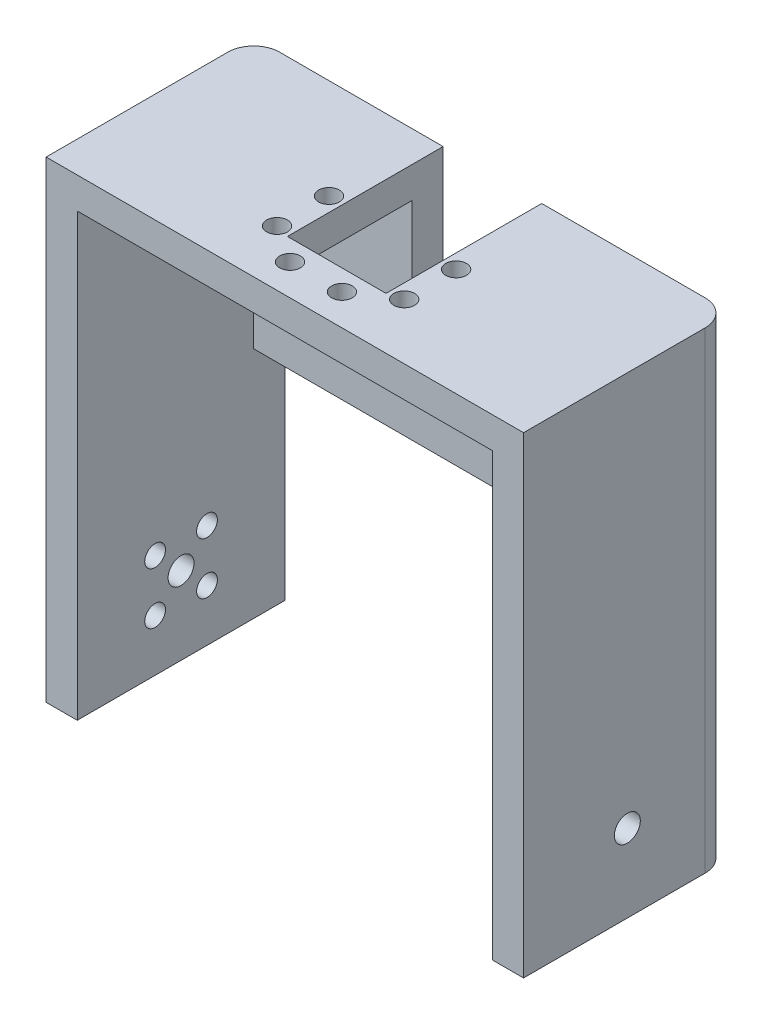
ISO-10303-21;
HEADER;
FILE_DESCRIPTION(('STEP AP214'),'2;1');
FILE_NAME('part.step','',(''),(''),'','','');
FILE_SCHEMA(('AUTOMOTIVE_DESIGN { 1 0 10303 214 1 1 1 1 }'));
ENDSEC;
DATA;
#1=APPLICATION_CONTEXT('core data for automotive mechanical design processes');
#2=APPLICATION_PROTOCOL_DEFINITION('international standard','automotive_design',2000,#1);
#3=PRODUCT_CONTEXT('',#1,'mechanical');
#4=PRODUCT('Part','Part','',(#3));
#5=PRODUCT_RELATED_PRODUCT_CATEGORY('part','',(#4));
#6=PRODUCT_DEFINITION_FORMATION('','',#4);
#7=PRODUCT_DEFINITION_CONTEXT('part definition',#1,'design');
#8=PRODUCT_DEFINITION('design','',#6,#7);
#9=PRODUCT_DEFINITION_SHAPE('','',#8);
#10=(LENGTH_UNIT() NAMED_UNIT(*) SI_UNIT(.MILLI.,.METRE.));
#11=(NAMED_UNIT(*) PLANE_ANGLE_UNIT() SI_UNIT($,.RADIAN.));
#12=(NAMED_UNIT(*) SI_UNIT($,.STERADIAN.) SOLID_ANGLE_UNIT());
#13=UNCERTAINTY_MEASURE_WITH_UNIT(LENGTH_MEASURE(1.E-05),#10,'distance_accuracy_value','');
#14=(GEOMETRIC_REPRESENTATION_CONTEXT(3) GLOBAL_UNCERTAINTY_ASSIGNED_CONTEXT((#13)) GLOBAL_UNIT_ASSIGNED_CONTEXT((#10,
#11,#12)) REPRESENTATION_CONTEXT('',''));
#15=CARTESIAN_POINT('',(0.,0.,0.));
#16=DIRECTION('',(0.,0.,1.));
#17=DIRECTION('',(1.,0.,0.));
#18=AXIS2_PLACEMENT_3D('',#15,#16,#17);
#19=CARTESIAN_POINT('',(-31.1459169574739,-11.0012437810945,40.));
#20=DIRECTION('',(-1.,0.,0.));
#21=DIRECTION('',(0.,0.,1.));
#22=AXIS2_PLACEMENT_3D('',#19,#20,#21);
#23=PLANE('',#22);
#24=CARTESIAN_POINT('',(-31.1459169574739,-41.0012437810945,25.));
#25=DIRECTION('',(-1.,0.,0.));
#26=DIRECTION('',(0.,0.,1.));
#27=AXIS2_PLACEMENT_3D('',#24,#25,#26);
#28=CIRCLE('',#27,2.);
#29=CARTESIAN_POINT('',(-31.1459169574739,-41.0012437810945,27.));
#30=VERTEX_POINT('',#29);
#31=EDGE_CURVE('E185',#30,#30,#28,.T.);
#32=ORIENTED_EDGE('',*,*,#31,.T.);
#33=EDGE_LOOP('',(#32));
#34=FACE_BOUND('',#33,.T.);
#35=CARTESIAN_POINT('',(-31.1459169574739,-51.0012437810945,15.));
#36=DIRECTION('',(-1.,0.,0.));
#37=DIRECTION('',(0.,0.,1.));
#38=AXIS2_PLACEMENT_3D('',#35,#36,#37);
#39=CIRCLE('',#38,2.);
#40=CARTESIAN_POINT('',(-31.1459169574739,-51.0012437810945,17.));
#41=VERTEX_POINT('',#40);
#42=EDGE_CURVE('E188',#41,#41,#39,.T.);
#43=ORIENTED_EDGE('',*,*,#42,.T.);
#44=EDGE_LOOP('',(#43));
#45=FACE_BOUND('',#44,.T.);
#46=CARTESIAN_POINT('',(-31.1459169574739,-41.0012437810945,15.));
#47=DIRECTION('',(-1.,0.,0.));
#48=DIRECTION('',(0.,0.,1.));
#49=AXIS2_PLACEMENT_3D('',#46,#47,#48);
#50=CIRCLE('',#49,2.);
#51=CARTESIAN_POINT('',(-31.1459169574739,-41.0012437810945,17.));
#52=VERTEX_POINT('',#51);
#53=EDGE_CURVE('E520',#52,#52,#50,.T.);
#54=ORIENTED_EDGE('',*,*,#53,.T.);
#55=EDGE_LOOP('',(#54));
#56=FACE_BOUND('',#55,.T.);
#57=CARTESIAN_POINT('',(-31.1459169574739,-51.0012437810945,25.));
#58=DIRECTION('',(-1.,0.,0.));
#59=DIRECTION('',(0.,0.,1.));
#60=AXIS2_PLACEMENT_3D('',#57,#58,#59);
#61=CIRCLE('',#60,2.);
#62=CARTESIAN_POINT('',(-31.1459169574739,-51.0012437810945,27.));
#63=VERTEX_POINT('',#62);
#64=EDGE_CURVE('E517',#63,#63,#61,.T.);
#65=ORIENTED_EDGE('',*,*,#64,.T.);
#66=EDGE_LOOP('',(#65));
#67=FACE_BOUND('',#66,.T.);
#68=CARTESIAN_POINT('',(-31.1459169574739,-46.0012437810945,20.));
#69=DIRECTION('',(-1.,0.,0.));
#70=DIRECTION('',(0.,0.,1.));
#71=AXIS2_PLACEMENT_3D('',#68,#69,#70);
#72=CIRCLE('',#71,2.5);
#73=CARTESIAN_POINT('',(-31.1459169574739,-46.0012437810945,22.5));
#74=VERTEX_POINT('',#73);
#75=EDGE_CURVE('E223',#74,#74,#72,.T.);
#76=ORIENTED_EDGE('',*,*,#75,.T.);
#77=EDGE_LOOP('',(#76));
#78=FACE_BOUND('',#77,.T.);
#79=DIRECTION('',(0.,1.,0.));
#80=VECTOR('',#79,1.);
#81=CARTESIAN_POINT('',(-31.1459169574739,-16.0012437810945,6.));
#82=LINE('',#81,#80);
#83=CARTESIAN_POINT('',(-31.1459169574739,-16.0012437810945,6.));
#84=VERTEX_POINT('',#83);
#85=CARTESIAN_POINT('',(-31.1459169574739,23.9987562189055,6.));
#86=VERTEX_POINT('',#85);
#87=EDGE_CURVE('E207',#84,#86,#82,.T.);
#88=ORIENTED_EDGE('',*,*,#87,.T.);
#89=DIRECTION('',(0.,0.,-1.));
#90=VECTOR('',#89,1.);
#91=CARTESIAN_POINT('',(-31.1459169574739,23.9987562189055,40.));
#92=LINE('',#91,#90);
#93=CARTESIAN_POINT('',(-31.1459169574739,23.9987562189055,40.));
#94=VERTEX_POINT('',#93);
#95=EDGE_CURVE('E327',#94,#86,#92,.T.);
#96=ORIENTED_EDGE('',*,*,#95,.F.);
#97=DIRECTION('',(0.,1.,0.));
#98=VECTOR('',#97,1.);
#99=CARTESIAN_POINT('',(-31.1459169574739,-11.0012437810945,40.));
#100=LINE('',#99,#98);
#101=CARTESIAN_POINT('',(-31.1459169574739,-61.0012437810945,40.));
#102=VERTEX_POINT('',#101);
#103=EDGE_CURVE('E315',#102,#94,#100,.T.);
#104=ORIENTED_EDGE('',*,*,#103,.F.);
#105=DIRECTION('',(0.,0.,1.));
#106=VECTOR('',#105,1.);
#107=CARTESIAN_POINT('',(-31.1459169574739,-61.0012437810945,40.));
#108=LINE('',#107,#106);
#109=CARTESIAN_POINT('',(-31.1459169574739,-61.0012437810945,0.));
#110=VERTEX_POINT('',#109);
#111=EDGE_CURVE('E241',#110,#102,#108,.T.);
#112=ORIENTED_EDGE('',*,*,#111,.F.);
#113=DIRECTION('',(0.,1.,0.));
#114=VECTOR('',#113,1.);
#115=CARTESIAN_POINT('',(-31.1459169574739,-11.0012437810945,0.));
#116=LINE('',#115,#114);
#117=CARTESIAN_POINT('',(-31.1459169574739,-16.0012437810945,0.));
#118=VERTEX_POINT('',#117);
#119=EDGE_CURVE('E313',#110,#118,#116,.T.);
#120=ORIENTED_EDGE('',*,*,#119,.T.);
#121=DIRECTION('',(0.,0.,-1.));
#122=VECTOR('',#121,1.);
#123=CARTESIAN_POINT('',(-31.1459169574739,-16.0012437810945,0.));
#124=LINE('',#123,#122);
#125=EDGE_CURVE('E194',#84,#118,#124,.T.);
#126=ORIENTED_EDGE('',*,*,#125,.F.);
#127=EDGE_LOOP('',(#88,#96,#104,#112,#120,#126));
#128=FACE_BOUND('',#127,.T.);
#129=ADVANCED_FACE('F36',(#34,#45,#56,#67,#78,#128),#23,.F.);
#130=CARTESIAN_POINT('',(-31.1459169574739,23.9987562189055,40.));
#131=DIRECTION('',(0.,1.,0.));
#132=DIRECTION('',(0.,0.,1.));
#133=AXIS2_PLACEMENT_3D('',#130,#131,#132);
#134=PLANE('',#133);
#135=CARTESIAN_POINT('',(-3.39591695747392,23.9987562189055,19.25));
#136=DIRECTION('',(0.,1.,0.));
#137=DIRECTION('',(0.,0.,1.));
#138=AXIS2_PLACEMENT_3D('',#135,#136,#137);
#139=CIRCLE('',#138,2.);
#140=CARTESIAN_POINT('',(-3.39591695747392,23.9987562189055,21.25));
#141=VERTEX_POINT('',#140);
#142=EDGE_CURVE('E290',#141,#141,#139,.T.);
#143=ORIENTED_EDGE('',*,*,#142,.T.);
#144=EDGE_LOOP('',(#143));
#145=FACE_BOUND('',#144,.T.);
#146=CARTESIAN_POINT('',(-3.39591695747392,23.9987562189055,29.25));
#147=DIRECTION('',(0.,1.,0.));
#148=DIRECTION('',(0.,0.,1.));
#149=AXIS2_PLACEMENT_3D('',#146,#147,#148);
#150=CIRCLE('',#149,2.);
#151=CARTESIAN_POINT('',(-3.39591695747392,23.9987562189055,31.25));
#152=VERTEX_POINT('',#151);
#153=EDGE_CURVE('E287',#152,#152,#150,.T.);
#154=ORIENTED_EDGE('',*,*,#153,.T.);
#155=EDGE_LOOP('',(#154));
#156=FACE_BOUND('',#155,.T.);
#157=DIRECTION('',(0.,0.,1.));
#158=VECTOR('',#157,1.);
#159=CARTESIAN_POINT('',(-0.645916957473888,23.9987562189055,40.));
#160=LINE('',#159,#158);
#161=CARTESIAN_POINT('',(-0.645916957473899,23.9987562189055,6.));
#162=VERTEX_POINT('',#161);
#163=CARTESIAN_POINT('',(-0.64591695747389,23.9987562189055,30.));
#164=VERTEX_POINT('',#163);
#165=EDGE_CURVE('E278',#162,#164,#160,.T.);
#166=ORIENTED_EDGE('',*,*,#165,.T.);
#167=DIRECTION('',(1.,0.,0.));
#168=VECTOR('',#167,1.);
#169=CARTESIAN_POINT('',(-31.1459169574739,23.9987562189055,30.));
#170=LINE('',#169,#168);
#171=CARTESIAN_POINT('',(18.3540830425261,23.9987562189055,30.));
#172=VERTEX_POINT('',#171);
#173=EDGE_CURVE('E171',#164,#172,#170,.T.);
#174=ORIENTED_EDGE('',*,*,#173,.T.);
#175=DIRECTION('',(0.,0.,-1.));
#176=VECTOR('',#175,1.);
#177=CARTESIAN_POINT('',(18.3540830425261,23.9987562189055,40.));
#178=LINE('',#177,#176);
#179=CARTESIAN_POINT('',(18.3540830425261,23.9987562189055,6.));
#180=VERTEX_POINT('',#179);
#181=EDGE_CURVE('E170',#172,#180,#178,.T.);
#182=ORIENTED_EDGE('',*,*,#181,.T.);
#183=DIRECTION('',(-1.,0.,0.));
#184=VECTOR('',#183,1.);
#185=CARTESIAN_POINT('',(-31.1459169574739,23.9987562189055,6.));
#186=LINE('',#185,#184);
#187=CARTESIAN_POINT('',(48.8540830425261,23.9987562189055,6.));
#188=VERTEX_POINT('',#187);
#189=EDGE_CURVE('E198',#188,#180,#186,.T.);
#190=ORIENTED_EDGE('',*,*,#189,.F.);
#191=DIRECTION('',(0.,0.,-1.));
#192=VECTOR('',#191,1.);
#193=CARTESIAN_POINT('',(48.8540830425261,23.9987562189055,40.));
#194=LINE('',#193,#192);
#195=CARTESIAN_POINT('',(48.8540830425261,23.9987562189055,40.));
#196=VERTEX_POINT('',#195);
#197=EDGE_CURVE('E322',#196,#188,#194,.T.);
#198=ORIENTED_EDGE('',*,*,#197,.F.);
#199=DIRECTION('',(1.,0.,0.));
#200=VECTOR('',#199,1.);
#201=CARTESIAN_POINT('',(-31.1459169574739,23.9987562189055,40.));
#202=LINE('',#201,#200);
#203=EDGE_CURVE('E317',#94,#196,#202,.T.);
#204=ORIENTED_EDGE('',*,*,#203,.F.);
#205=ORIENTED_EDGE('',*,*,#95,.T.);
#206=EDGE_CURVE('E192',#162,#86,#186,.T.);
#207=ORIENTED_EDGE('',*,*,#206,.F.);
#208=EDGE_LOOP('',(#166,#174,#182,#190,#198,#204,#205,#207));
#209=FACE_BOUND('',#208,.T.);
#210=CARTESIAN_POINT('',(3.85408304252608,23.9987562189055,34.));
#211=DIRECTION('',(0.,1.,0.));
#212=DIRECTION('',(0.,0.,1.));
#213=AXIS2_PLACEMENT_3D('',#210,#211,#212);
#214=CIRCLE('',#213,2.);
#215=CARTESIAN_POINT('',(3.85408304252608,23.9987562189055,36.));
#216=VERTEX_POINT('',#215);
#217=EDGE_CURVE('E284',#216,#216,#214,.T.);
#218=ORIENTED_EDGE('',*,*,#217,.T.);
#219=EDGE_LOOP('',(#218));
#220=FACE_BOUND('',#219,.T.);
#221=CARTESIAN_POINT('',(13.8540830425261,23.9987562189055,34.));
#222=DIRECTION('',(0.,1.,0.));
#223=DIRECTION('',(0.,0.,1.));
#224=AXIS2_PLACEMENT_3D('',#221,#222,#223);
#225=CIRCLE('',#224,2.);
#226=CARTESIAN_POINT('',(13.8540830425261,23.9987562189055,36.));
#227=VERTEX_POINT('',#226);
#228=EDGE_CURVE('E274',#227,#227,#225,.T.);
#229=ORIENTED_EDGE('',*,*,#228,.T.);
#230=EDGE_LOOP('',(#229));
#231=FACE_BOUND('',#230,.T.);
#232=CARTESIAN_POINT('',(21.1040830425261,23.9987562189055,19.25));
#233=DIRECTION('',(0.,1.,0.));
#234=DIRECTION('',(0.,0.,1.));
#235=AXIS2_PLACEMENT_3D('',#232,#233,#234);
#236=CIRCLE('',#235,2.00000000000001);
#237=CARTESIAN_POINT('',(21.1040830425261,23.9987562189055,21.25));
#238=VERTEX_POINT('',#237);
#239=EDGE_CURVE('E293',#238,#238,#236,.T.);
#240=ORIENTED_EDGE('',*,*,#239,.T.);
#241=EDGE_LOOP('',(#240));
#242=FACE_BOUND('',#241,.T.);
#243=CARTESIAN_POINT('',(21.1040830425261,23.9987562189055,29.25));
#244=DIRECTION('',(0.,1.,0.));
#245=DIRECTION('',(0.,0.,1.));
#246=AXIS2_PLACEMENT_3D('',#243,#244,#245);
#247=CIRCLE('',#246,2.);
#248=CARTESIAN_POINT('',(21.1040830425261,23.9987562189055,31.25));
#249=VERTEX_POINT('',#248);
#250=EDGE_CURVE('E296',#249,#249,#247,.T.);
#251=ORIENTED_EDGE('',*,*,#250,.T.);
#252=EDGE_LOOP('',(#251));
#253=FACE_BOUND('',#252,.T.);
#254=ADVANCED_FACE('F380',(#145,#156,#209,#220,#231,#242,#253),#134,.F.);
#255=CARTESIAN_POINT('',(48.8540830425261,23.9987562189055,40.));
#256=DIRECTION('',(1.,0.,0.));
#257=DIRECTION('',(0.,1.,0.));
#258=AXIS2_PLACEMENT_3D('',#255,#256,#257);
#259=PLANE('',#258);
#260=CARTESIAN_POINT('',(48.8540830425261,-46.0012437810945,20.));
#261=DIRECTION('',(1.,0.,0.));
#262=DIRECTION('',(0.,1.,0.));
#263=AXIS2_PLACEMENT_3D('',#260,#261,#262);
#264=CIRCLE('',#263,2.5);
#265=CARTESIAN_POINT('',(48.8540830425261,-43.5012437810945,20.));
#266=VERTEX_POINT('',#265);
#267=EDGE_CURVE('E220',#266,#266,#264,.T.);
#268=ORIENTED_EDGE('',*,*,#267,.T.);
#269=EDGE_LOOP('',(#268));
#270=FACE_BOUND('',#269,.T.);
#271=DIRECTION('',(0.,1.,0.));
#272=VECTOR('',#271,1.);
#273=CARTESIAN_POINT('',(48.8540830425261,-16.0012437810945,6.));
#274=LINE('',#273,#272);
#275=CARTESIAN_POINT('',(48.8540830425261,-16.0012437810945,6.));
#276=VERTEX_POINT('',#275);
#277=EDGE_CURVE('E211',#276,#188,#274,.T.);
#278=ORIENTED_EDGE('',*,*,#277,.F.);
#279=DIRECTION('',(0.,0.,1.));
#280=VECTOR('',#279,1.);
#281=CARTESIAN_POINT('',(48.8540830425261,-16.0012437810945,0.));
#282=LINE('',#281,#280);
#283=CARTESIAN_POINT('',(48.8540830425261,-16.0012437810945,0.));
#284=VERTEX_POINT('',#283);
#285=EDGE_CURVE('E201',#284,#276,#282,.T.);
#286=ORIENTED_EDGE('',*,*,#285,.F.);
#287=DIRECTION('',(0.,-1.,0.));
#288=VECTOR('',#287,1.);
#289=CARTESIAN_POINT('',(48.8540830425261,23.9987562189055,0.));
#290=LINE('',#289,#288);
#291=CARTESIAN_POINT('',(48.8540830425261,-61.0012437810945,0.));
#292=VERTEX_POINT('',#291);
#293=EDGE_CURVE('E318',#284,#292,#290,.T.);
#294=ORIENTED_EDGE('',*,*,#293,.T.);
#295=DIRECTION('',(0.,0.,-1.));
#296=VECTOR('',#295,1.);
#297=CARTESIAN_POINT('',(48.8540830425261,-61.0012437810945,40.));
#298=LINE('',#297,#296);
#299=CARTESIAN_POINT('',(48.8540830425261,-61.0012437810945,40.));
#300=VERTEX_POINT('',#299);
#301=EDGE_CURVE('E226',#300,#292,#298,.T.);
#302=ORIENTED_EDGE('',*,*,#301,.F.);
#303=DIRECTION('',(0.,-1.,0.));
#304=VECTOR('',#303,1.);
#305=CARTESIAN_POINT('',(48.8540830425261,23.9987562189055,40.));
#306=LINE('',#305,#304);
#307=EDGE_CURVE('E320',#196,#300,#306,.T.);
#308=ORIENTED_EDGE('',*,*,#307,.F.);
#309=ORIENTED_EDGE('',*,*,#197,.T.);
#310=EDGE_LOOP('',(#278,#286,#294,#302,#308,#309));
#311=FACE_BOUND('',#310,.T.);
#312=ADVANCED_FACE('F388',(#270,#311),#259,.F.);
#313=CARTESIAN_POINT('',(0.,0.,40.));
#314=DIRECTION('',(0.,0.,-1.));
#315=DIRECTION('',(-1.,0.,0.));
#316=AXIS2_PLACEMENT_3D('',#313,#314,#315);
#317=PLANE('',#316);
#318=DIRECTION('',(0.,-1.,0.));
#319=VECTOR('',#318,1.);
#320=CARTESIAN_POINT('',(-37.1459169574739,-1.00124378109452,40.));
#321=LINE('',#320,#319);
#322=CARTESIAN_POINT('',(-37.1459169574739,29.9987562189055,40.));
#323=VERTEX_POINT('',#322);
#324=CARTESIAN_POINT('',(-37.1459169574739,-61.0012437810945,40.));
#325=VERTEX_POINT('',#324);
#326=EDGE_CURVE('E309',#323,#325,#321,.T.);
#327=ORIENTED_EDGE('',*,*,#326,.T.);
#328=DIRECTION('',(-1.,0.,0.));
#329=VECTOR('',#328,1.);
#330=CARTESIAN_POINT('',(-37.1459169574739,-61.0012437810945,40.));
#331=LINE('',#330,#329);
#332=EDGE_CURVE('E244',#102,#325,#331,.T.);
#333=ORIENTED_EDGE('',*,*,#332,.F.);
#334=ORIENTED_EDGE('',*,*,#103,.T.);
#335=ORIENTED_EDGE('',*,*,#203,.T.);
#336=ORIENTED_EDGE('',*,*,#307,.T.);
#337=DIRECTION('',(-1.,0.,0.));
#338=VECTOR('',#337,1.);
#339=CARTESIAN_POINT('',(48.8540830425261,-61.0012437810945,40.));
#340=LINE('',#339,#338);
#341=CARTESIAN_POINT('',(54.8540830425261,-61.0012437810945,40.));
#342=VERTEX_POINT('',#341);
#343=EDGE_CURVE('E234',#342,#300,#340,.T.);
#344=ORIENTED_EDGE('',*,*,#343,.F.);
#345=DIRECTION('',(0.,1.,0.));
#346=VECTOR('',#345,1.);
#347=CARTESIAN_POINT('',(54.8540830425261,29.9987562189055,40.));
#348=LINE('',#347,#346);
#349=CARTESIAN_POINT('',(54.8540830425261,29.9987562189055,40.));
#350=VERTEX_POINT('',#349);
#351=EDGE_CURVE('E299',#342,#350,#348,.T.);
#352=ORIENTED_EDGE('',*,*,#351,.T.);
#353=DIRECTION('',(-1.,0.,0.));
#354=VECTOR('',#353,1.);
#355=CARTESIAN_POINT('',(-37.1459169574739,29.9987562189055,40.));
#356=LINE('',#355,#354);
#357=EDGE_CURVE('E306',#350,#323,#356,.T.);
#358=ORIENTED_EDGE('',*,*,#357,.T.);
#359=EDGE_LOOP('',(#327,#333,#334,#335,#336,#344,#352,#358));
#360=FACE_BOUND('',#359,.T.);
#361=ADVANCED_FACE('F359',(#360),#317,.F.);
#362=CARTESIAN_POINT('',(0.,0.,0.));
#363=DIRECTION('',(0.,0.,-1.));
#364=DIRECTION('',(-1.,0.,0.));
#365=AXIS2_PLACEMENT_3D('',#362,#363,#364);
#366=PLANE('',#365);
#367=DIRECTION('',(-1.,0.,0.));
#368=VECTOR('',#367,1.);
#369=CARTESIAN_POINT('',(-37.1459169574739,29.9987562189055,0.));
#370=LINE('',#369,#368);
#371=CARTESIAN_POINT('',(49.8540830425261,29.9987562189055,0.));
#372=VERTEX_POINT('',#371);
#373=CARTESIAN_POINT('',(18.3540830425261,29.9987562189055,0.));
#374=VERTEX_POINT('',#373);
#375=EDGE_CURVE('E300',#372,#374,#370,.T.);
#376=ORIENTED_EDGE('',*,*,#375,.F.);
#377=DIRECTION('',(0.,1.,0.));
#378=VECTOR('',#377,1.);
#379=CARTESIAN_POINT('',(49.8540830425261,0.,0.));
#380=LINE('',#379,#378);
#381=CARTESIAN_POINT('',(49.8540830425261,-61.0012437810945,0.));
#382=VERTEX_POINT('',#381);
#383=EDGE_CURVE('E346',#372,#382,#380,.F.);
#384=ORIENTED_EDGE('',*,*,#383,.T.);
#385=DIRECTION('',(1.,0.,0.));
#386=VECTOR('',#385,1.);
#387=CARTESIAN_POINT('',(48.8540830425261,-61.0012437810945,0.));
#388=LINE('',#387,#386);
#389=EDGE_CURVE('E229',#292,#382,#388,.T.);
#390=ORIENTED_EDGE('',*,*,#389,.F.);
#391=ORIENTED_EDGE('',*,*,#293,.F.);
#392=DIRECTION('',(1.,0.,0.));
#393=VECTOR('',#392,1.);
#394=CARTESIAN_POINT('',(-31.1459169574739,-16.0012437810945,0.));
#395=LINE('',#394,#393);
#396=EDGE_CURVE('E197',#118,#284,#395,.T.);
#397=ORIENTED_EDGE('',*,*,#396,.F.);
#398=ORIENTED_EDGE('',*,*,#119,.F.);
#399=DIRECTION('',(1.,0.,0.));
#400=VECTOR('',#399,1.);
#401=CARTESIAN_POINT('',(-37.1459169574739,-61.0012437810945,0.));
#402=LINE('',#401,#400);
#403=CARTESIAN_POINT('',(-32.1459169574739,-61.0012437810945,0.));
#404=VERTEX_POINT('',#403);
#405=EDGE_CURVE('E239',#404,#110,#402,.T.);
#406=ORIENTED_EDGE('',*,*,#405,.F.);
#407=DIRECTION('',(0.,-1.,0.));
#408=VECTOR('',#407,1.);
#409=CARTESIAN_POINT('',(-32.1459169574739,0.,0.));
#410=LINE('',#409,#408);
#411=CARTESIAN_POINT('',(-32.1459169574739,29.9987562189055,0.));
#412=VERTEX_POINT('',#411);
#413=EDGE_CURVE('E344',#404,#412,#410,.F.);
#414=ORIENTED_EDGE('',*,*,#413,.T.);
#415=CARTESIAN_POINT('',(-0.645916957473895,29.9987562189055,0.));
#416=VERTEX_POINT('',#415);
#417=EDGE_CURVE('E303',#416,#412,#370,.T.);
#418=ORIENTED_EDGE('',*,*,#417,.F.);
#419=DIRECTION('',(0.,1.,0.));
#420=VECTOR('',#419,1.);
#421=CARTESIAN_POINT('',(-0.645916957473894,0.,0.));
#422=LINE('',#421,#420);
#423=CARTESIAN_POINT('',(-0.645916957473902,3.59875621890549,0.));
#424=VERTEX_POINT('',#423);
#425=EDGE_CURVE('E183',#424,#416,#422,.T.);
#426=ORIENTED_EDGE('',*,*,#425,.F.);
#427=DIRECTION('',(-1.,0.,0.));
#428=VECTOR('',#427,1.);
#429=CARTESIAN_POINT('',(18.3540830425261,3.59875621890549,0.));
#430=LINE('',#429,#428);
#431=CARTESIAN_POINT('',(18.3540830425261,3.59875621890549,0.));
#432=VERTEX_POINT('',#431);
#433=EDGE_CURVE('E176',#432,#424,#430,.T.);
#434=ORIENTED_EDGE('',*,*,#433,.F.);
#435=DIRECTION('',(0.,-1.,0.));
#436=VECTOR('',#435,1.);
#437=CARTESIAN_POINT('',(18.3540830425261,0.,0.));
#438=LINE('',#437,#436);
#439=EDGE_CURVE('E160',#374,#432,#438,.T.);
#440=ORIENTED_EDGE('',*,*,#439,.F.);
#441=EDGE_LOOP('',(#376,#384,#390,#391,#397,#398,#406,#414,#418,#426,#434,#440));
#442=FACE_BOUND('',#441,.T.);
#443=ADVANCED_FACE('F181',(#442),#366,.T.);
#444=CARTESIAN_POINT('',(-37.1459169574739,-1.00124378109452,0.));
#445=DIRECTION('',(-1.,0.,0.));
#446=DIRECTION('',(0.,0.,1.));
#447=AXIS2_PLACEMENT_3D('',#444,#445,#446);
#448=PLANE('',#447);
#449=CARTESIAN_POINT('',(-37.1459169574739,-41.0012437810945,25.));
#450=DIRECTION('',(-1.,0.,0.));
#451=DIRECTION('',(0.,0.,1.));
#452=AXIS2_PLACEMENT_3D('',#449,#450,#451);
#453=CIRCLE('',#452,2.);
#454=CARTESIAN_POINT('',(-37.1459169574739,-41.0012437810945,27.));
#455=VERTEX_POINT('',#454);
#456=EDGE_CURVE('E500',#455,#455,#453,.T.);
#457=ORIENTED_EDGE('',*,*,#456,.F.);
#458=EDGE_LOOP('',(#457));
#459=FACE_BOUND('',#458,.T.);
#460=CARTESIAN_POINT('',(-37.1459169574739,-51.0012437810945,15.));
#461=DIRECTION('',(-1.,0.,0.));
#462=DIRECTION('',(0.,0.,1.));
#463=AXIS2_PLACEMENT_3D('',#460,#461,#462);
#464=CIRCLE('',#463,2.);
#465=CARTESIAN_POINT('',(-37.1459169574739,-51.0012437810945,17.));
#466=VERTEX_POINT('',#465);
#467=EDGE_CURVE('E504',#466,#466,#464,.T.);
#468=ORIENTED_EDGE('',*,*,#467,.F.);
#469=EDGE_LOOP('',(#468));
#470=FACE_BOUND('',#469,.T.);
#471=CARTESIAN_POINT('',(-37.1459169574739,-41.0012437810945,15.));
#472=DIRECTION('',(-1.,0.,0.));
#473=DIRECTION('',(0.,0.,1.));
#474=AXIS2_PLACEMENT_3D('',#471,#472,#473);
#475=CIRCLE('',#474,2.);
#476=CARTESIAN_POINT('',(-37.1459169574739,-41.0012437810945,17.));
#477=VERTEX_POINT('',#476);
#478=EDGE_CURVE('E508',#477,#477,#475,.T.);
#479=ORIENTED_EDGE('',*,*,#478,.F.);
#480=EDGE_LOOP('',(#479));
#481=FACE_BOUND('',#480,.T.);
#482=CARTESIAN_POINT('',(-37.1459169574739,-51.0012437810945,25.));
#483=DIRECTION('',(-1.,0.,0.));
#484=DIRECTION('',(0.,0.,1.));
#485=AXIS2_PLACEMENT_3D('',#482,#483,#484);
#486=CIRCLE('',#485,2.);
#487=CARTESIAN_POINT('',(-37.1459169574739,-51.0012437810945,27.));
#488=VERTEX_POINT('',#487);
#489=EDGE_CURVE('E512',#488,#488,#486,.T.);
#490=ORIENTED_EDGE('',*,*,#489,.F.);
#491=EDGE_LOOP('',(#490));
#492=FACE_BOUND('',#491,.T.);
#493=CARTESIAN_POINT('',(-37.1459169574739,-46.0012437810945,20.));
#494=DIRECTION('',(-1.,0.,0.));
#495=DIRECTION('',(0.,0.,1.));
#496=AXIS2_PLACEMENT_3D('',#493,#494,#495);
#497=CIRCLE('',#496,2.5);
#498=CARTESIAN_POINT('',(-37.1459169574739,-46.0012437810945,22.5));
#499=VERTEX_POINT('',#498);
#500=EDGE_CURVE('E217',#499,#499,#497,.T.);
#501=ORIENTED_EDGE('',*,*,#500,.F.);
#502=EDGE_LOOP('',(#501));
#503=FACE_BOUND('',#502,.T.);
#504=DIRECTION('',(0.,0.,1.));
#505=VECTOR('',#504,1.);
#506=CARTESIAN_POINT('',(-37.1459169574739,29.9987562189055,0.));
#507=LINE('',#506,#505);
#508=CARTESIAN_POINT('',(-37.1459169574739,29.9987562189055,5.));
#509=VERTEX_POINT('',#508);
#510=EDGE_CURVE('E311',#509,#323,#507,.T.);
#511=ORIENTED_EDGE('',*,*,#510,.F.);
#512=DIRECTION('',(0.,-1.,0.));
#513=VECTOR('',#512,1.);
#514=CARTESIAN_POINT('',(-37.1459169574739,-1.00124378109452,5.));
#515=LINE('',#514,#513);
#516=CARTESIAN_POINT('',(-37.1459169574739,-61.0012437810945,5.));
#517=VERTEX_POINT('',#516);
#518=EDGE_CURVE('E44',#509,#517,#515,.T.);
#519=ORIENTED_EDGE('',*,*,#518,.T.);
#520=DIRECTION('',(0.,0.,-1.));
#521=VECTOR('',#520,1.);
#522=CARTESIAN_POINT('',(-37.1459169574739,-61.0012437810945,40.));
#523=LINE('',#522,#521);
#524=EDGE_CURVE('E237',#325,#517,#523,.T.);
#525=ORIENTED_EDGE('',*,*,#524,.F.);
#526=ORIENTED_EDGE('',*,*,#326,.F.);
#527=EDGE_LOOP('',(#511,#519,#525,#526));
#528=FACE_BOUND('',#527,.T.);
#529=ADVANCED_FACE('F352',(#459,#470,#481,#492,#503,#528),#448,.T.);
#530=CARTESIAN_POINT('',(-37.1459169574739,29.9987562189055,0.));
#531=DIRECTION('',(0.,1.,0.));
#532=DIRECTION('',(-1.,0.,0.));
#533=AXIS2_PLACEMENT_3D('',#530,#531,#532);
#534=PLANE('',#533);
#535=CARTESIAN_POINT('',(21.1040830425261,29.9987562189055,29.25));
#536=DIRECTION('',(0.,1.,0.));
#537=DIRECTION('',(0.,0.,-1.));
#538=AXIS2_PLACEMENT_3D('',#535,#536,#537);
#539=CIRCLE('',#538,2.);
#540=CARTESIAN_POINT('',(21.1040830425261,29.9987562189055,27.25));
#541=VERTEX_POINT('',#540);
#542=EDGE_CURVE('E247',#541,#541,#539,.T.);
#543=ORIENTED_EDGE('',*,*,#542,.F.);
#544=EDGE_LOOP('',(#543));
#545=FACE_BOUND('',#544,.T.);
#546=CARTESIAN_POINT('',(21.1040830425261,29.9987562189055,19.25));
#547=DIRECTION('',(0.,1.,0.));
#548=DIRECTION('',(0.,0.,-1.));
#549=AXIS2_PLACEMENT_3D('',#546,#547,#548);
#550=CIRCLE('',#549,2.00000000000001);
#551=CARTESIAN_POINT('',(21.1040830425261,29.9987562189055,17.25));
#552=VERTEX_POINT('',#551);
#553=EDGE_CURVE('E267',#552,#552,#550,.T.);
#554=ORIENTED_EDGE('',*,*,#553,.F.);
#555=EDGE_LOOP('',(#554));
#556=FACE_BOUND('',#555,.T.);
#557=CARTESIAN_POINT('',(-3.39591695747392,29.9987562189055,19.25));
#558=DIRECTION('',(0.,1.,0.));
#559=DIRECTION('',(0.,0.,1.));
#560=AXIS2_PLACEMENT_3D('',#557,#558,#559);
#561=CIRCLE('',#560,2.);
#562=CARTESIAN_POINT('',(-3.39591695747392,29.9987562189055,21.25));
#563=VERTEX_POINT('',#562);
#564=EDGE_CURVE('E264',#563,#563,#561,.T.);
#565=ORIENTED_EDGE('',*,*,#564,.F.);
#566=EDGE_LOOP('',(#565));
#567=FACE_BOUND('',#566,.T.);
#568=CARTESIAN_POINT('',(-3.39591695747392,29.9987562189055,29.25));
#569=DIRECTION('',(0.,1.,0.));
#570=DIRECTION('',(0.,0.,1.));
#571=AXIS2_PLACEMENT_3D('',#568,#569,#570);
#572=CIRCLE('',#571,2.);
#573=CARTESIAN_POINT('',(-3.39591695747392,29.9987562189055,31.25));
#574=VERTEX_POINT('',#573);
#575=EDGE_CURVE('E261',#574,#574,#572,.T.);
#576=ORIENTED_EDGE('',*,*,#575,.F.);
#577=EDGE_LOOP('',(#576));
#578=FACE_BOUND('',#577,.T.);
#579=CARTESIAN_POINT('',(3.85408304252608,29.9987562189055,34.));
#580=DIRECTION('',(0.,1.,0.));
#581=DIRECTION('',(0.,0.,-1.));
#582=AXIS2_PLACEMENT_3D('',#579,#580,#581);
#583=CIRCLE('',#582,2.);
#584=CARTESIAN_POINT('',(3.85408304252608,29.9987562189055,32.));
#585=VERTEX_POINT('',#584);
#586=EDGE_CURVE('E250',#585,#585,#583,.T.);
#587=ORIENTED_EDGE('',*,*,#586,.F.);
#588=EDGE_LOOP('',(#587));
#589=FACE_BOUND('',#588,.T.);
#590=DIRECTION('',(0.,0.,1.));
#591=VECTOR('',#590,1.);
#592=CARTESIAN_POINT('',(54.8540830425261,29.9987562189055,0.));
#593=LINE('',#592,#591);
#594=CARTESIAN_POINT('',(54.8540830425261,29.9987562189055,5.));
#595=VERTEX_POINT('',#594);
#596=EDGE_CURVE('E302',#595,#350,#593,.T.);
#597=ORIENTED_EDGE('',*,*,#596,.F.);
#598=CARTESIAN_POINT('',(49.8540830425261,29.9987562189055,5.));
#599=DIRECTION('',(0.,1.,0.));
#600=DIRECTION('',(-1.,0.,0.));
#601=AXIS2_PLACEMENT_3D('',#598,#599,#600);
#602=CIRCLE('',#601,5.);
#603=EDGE_CURVE('E342',#595,#372,#602,.T.);
#604=ORIENTED_EDGE('',*,*,#603,.T.);
#605=ORIENTED_EDGE('',*,*,#375,.T.);
#606=DIRECTION('',(0.,0.,-1.));
#607=VECTOR('',#606,1.);
#608=CARTESIAN_POINT('',(18.3540830425261,29.9987562189055,-12.));
#609=LINE('',#608,#607);
#610=CARTESIAN_POINT('',(18.3540830425261,29.9987562189055,30.));
#611=VERTEX_POINT('',#610);
#612=EDGE_CURVE('E166',#611,#374,#609,.T.);
#613=ORIENTED_EDGE('',*,*,#612,.F.);
#614=DIRECTION('',(1.,0.,0.));
#615=VECTOR('',#614,1.);
#616=CARTESIAN_POINT('',(-0.64591695747389,29.9987562189055,30.));
#617=LINE('',#616,#615);
#618=CARTESIAN_POINT('',(-0.64591695747389,29.9987562189055,30.));
#619=VERTEX_POINT('',#618);
#620=EDGE_CURVE('E249',#619,#611,#617,.T.);
#621=ORIENTED_EDGE('',*,*,#620,.F.);
#622=DIRECTION('',(0.,0.,1.));
#623=VECTOR('',#622,1.);
#624=CARTESIAN_POINT('',(-0.645916957473895,29.9987562189055,0.));
#625=LINE('',#624,#623);
#626=EDGE_CURVE('E330',#416,#619,#625,.T.);
#627=ORIENTED_EDGE('',*,*,#626,.F.);
#628=ORIENTED_EDGE('',*,*,#417,.T.);
#629=CARTESIAN_POINT('',(-32.1459169574739,29.9987562189055,5.));
#630=DIRECTION('',(0.,1.,0.));
#631=DIRECTION('',(-1.,0.,0.));
#632=AXIS2_PLACEMENT_3D('',#629,#630,#631);
#633=CIRCLE('',#632,5.);
#634=EDGE_CURVE('E340',#412,#509,#633,.T.);
#635=ORIENTED_EDGE('',*,*,#634,.T.);
#636=ORIENTED_EDGE('',*,*,#510,.T.);
#637=ORIENTED_EDGE('',*,*,#357,.F.);
#638=EDGE_LOOP('',(#597,#604,#605,#613,#621,#627,#628,#635,#636,#637));
#639=FACE_BOUND('',#638,.T.);
#640=CARTESIAN_POINT('',(13.8540830425261,29.9987562189055,34.));
#641=DIRECTION('',(0.,1.,0.));
#642=DIRECTION('',(0.,0.,1.));
#643=AXIS2_PLACEMENT_3D('',#640,#641,#642);
#644=CIRCLE('',#643,2.);
#645=CARTESIAN_POINT('',(13.8540830425261,29.9987562189055,36.));
#646=VERTEX_POINT('',#645);
#647=EDGE_CURVE('E256',#646,#646,#644,.T.);
#648=ORIENTED_EDGE('',*,*,#647,.F.);
#649=EDGE_LOOP('',(#648));
#650=FACE_BOUND('',#649,.T.);
#651=ADVANCED_FACE('F366',(#545,#556,#567,#578,#589,#639,#650),#534,.T.);
#652=CARTESIAN_POINT('',(54.8540830425261,29.9987562189055,0.));
#653=DIRECTION('',(1.,0.,0.));
#654=DIRECTION('',(0.,1.,0.));
#655=AXIS2_PLACEMENT_3D('',#652,#653,#654);
#656=PLANE('',#655);
#657=CARTESIAN_POINT('',(54.8540830425261,-46.0012437810945,20.));
#658=DIRECTION('',(-1.,0.,0.));
#659=DIRECTION('',(0.,0.,1.));
#660=AXIS2_PLACEMENT_3D('',#657,#658,#659);
#661=CIRCLE('',#660,2.5);
#662=CARTESIAN_POINT('',(54.8540830425261,-46.0012437810945,22.5));
#663=VERTEX_POINT('',#662);
#664=EDGE_CURVE('E214',#663,#663,#661,.T.);
#665=ORIENTED_EDGE('',*,*,#664,.T.);
#666=EDGE_LOOP('',(#665));
#667=FACE_BOUND('',#666,.T.);
#668=DIRECTION('',(0.,0.,1.));
#669=VECTOR('',#668,1.);
#670=CARTESIAN_POINT('',(54.8540830425261,-61.0012437810945,40.));
#671=LINE('',#670,#669);
#672=CARTESIAN_POINT('',(54.8540830425261,-61.0012437810945,5.));
#673=VERTEX_POINT('',#672);
#674=EDGE_CURVE('E232',#673,#342,#671,.T.);
#675=ORIENTED_EDGE('',*,*,#674,.F.);
#676=DIRECTION('',(0.,1.,0.));
#677=VECTOR('',#676,1.);
#678=CARTESIAN_POINT('',(54.8540830425261,29.9987562189055,5.));
#679=LINE('',#678,#677);
#680=EDGE_CURVE('E337',#673,#595,#679,.T.);
#681=ORIENTED_EDGE('',*,*,#680,.T.);
#682=ORIENTED_EDGE('',*,*,#596,.T.);
#683=ORIENTED_EDGE('',*,*,#351,.F.);
#684=EDGE_LOOP('',(#675,#681,#682,#683));
#685=FACE_BOUND('',#684,.T.);
#686=ADVANCED_FACE('F396',(#667,#685),#656,.T.);
#687=CARTESIAN_POINT('',(13.8540830425261,-11.0012437810945,34.));
#688=DIRECTION('',(0.,1.,0.));
#689=DIRECTION('',(0.,0.,1.));
#690=AXIS2_PLACEMENT_3D('',#687,#688,#689);
#691=CYLINDRICAL_SURFACE('',#690,2.);
#692=ORIENTED_EDGE('',*,*,#647,.T.);
#693=EDGE_LOOP('',(#692));
#694=FACE_BOUND('',#693,.T.);
#695=ORIENTED_EDGE('',*,*,#228,.F.);
#696=EDGE_LOOP('',(#695));
#697=FACE_BOUND('',#696,.T.);
#698=ADVANCED_FACE('F398',(#694,#697),#691,.F.);
#699=CARTESIAN_POINT('',(18.3540830425261,-11.0012437810945,-12.));
#700=DIRECTION('',(1.,0.,0.));
#701=DIRECTION('',(0.,0.,-1.));
#702=AXIS2_PLACEMENT_3D('',#699,#700,#701);
#703=PLANE('',#702);
#704=DIRECTION('',(0.,1.,0.));
#705=VECTOR('',#704,1.);
#706=CARTESIAN_POINT('',(18.3540830425261,-11.0012437810945,30.));
#707=LINE('',#706,#705);
#708=EDGE_CURVE('E254',#172,#611,#707,.T.);
#709=ORIENTED_EDGE('',*,*,#708,.T.);
#710=ORIENTED_EDGE('',*,*,#612,.T.);
#711=ORIENTED_EDGE('',*,*,#439,.T.);
#712=DIRECTION('',(0.,0.,-1.));
#713=VECTOR('',#712,1.);
#714=CARTESIAN_POINT('',(18.3540830425261,3.59875621890549,40.));
#715=LINE('',#714,#713);
#716=CARTESIAN_POINT('',(18.3540830425261,3.59875621890549,6.));
#717=VERTEX_POINT('',#716);
#718=EDGE_CURVE('E163',#717,#432,#715,.T.);
#719=ORIENTED_EDGE('',*,*,#718,.F.);
#720=DIRECTION('',(0.,-1.,0.));
#721=VECTOR('',#720,1.);
#722=CARTESIAN_POINT('',(18.3540830425261,-16.0012437810945,6.));
#723=LINE('',#722,#721);
#724=EDGE_CURVE('E335',#180,#717,#723,.T.);
#725=ORIENTED_EDGE('',*,*,#724,.F.);
#726=ORIENTED_EDGE('',*,*,#181,.F.);
#727=EDGE_LOOP('',(#709,#710,#711,#719,#725,#726));
#728=FACE_BOUND('',#727,.T.);
#729=ADVANCED_FACE('F162',(#728),#703,.F.);
#730=CARTESIAN_POINT('',(-0.64591695747389,-11.0012437810945,30.));
#731=DIRECTION('',(0.,0.,1.));
#732=DIRECTION('',(1.,0.,0.));
#733=AXIS2_PLACEMENT_3D('',#730,#731,#732);
#734=PLANE('',#733);
#735=DIRECTION('',(0.,1.,0.));
#736=VECTOR('',#735,1.);
#737=CARTESIAN_POINT('',(-0.64591695747389,-11.0012437810945,30.));
#738=LINE('',#737,#736);
#739=EDGE_CURVE('E253',#164,#619,#738,.T.);
#740=ORIENTED_EDGE('',*,*,#739,.T.);
#741=ORIENTED_EDGE('',*,*,#620,.T.);
#742=ORIENTED_EDGE('',*,*,#708,.F.);
#743=ORIENTED_EDGE('',*,*,#173,.F.);
#744=EDGE_LOOP('',(#740,#741,#742,#743));
#745=FACE_BOUND('',#744,.T.);
#746=ADVANCED_FACE('F463',(#745),#734,.F.);
#747=CARTESIAN_POINT('',(-0.645916957473895,-11.0012437810945,-12.));
#748=DIRECTION('',(-1.,0.,0.));
#749=DIRECTION('',(0.,0.,1.));
#750=AXIS2_PLACEMENT_3D('',#747,#748,#749);
#751=PLANE('',#750);
#752=ORIENTED_EDGE('',*,*,#425,.T.);
#753=ORIENTED_EDGE('',*,*,#626,.T.);
#754=ORIENTED_EDGE('',*,*,#739,.F.);
#755=ORIENTED_EDGE('',*,*,#165,.F.);
#756=DIRECTION('',(0.,1.,0.));
#757=VECTOR('',#756,1.);
#758=CARTESIAN_POINT('',(-0.645916957473906,-16.0012437810945,6.));
#759=LINE('',#758,#757);
#760=CARTESIAN_POINT('',(-0.645916957473902,3.59875621890549,6.));
#761=VERTEX_POINT('',#760);
#762=EDGE_CURVE('E333',#761,#162,#759,.T.);
#763=ORIENTED_EDGE('',*,*,#762,.F.);
#764=DIRECTION('',(0.,0.,-1.));
#765=VECTOR('',#764,1.);
#766=CARTESIAN_POINT('',(-0.645916957473902,3.59875621890549,40.));
#767=LINE('',#766,#765);
#768=EDGE_CURVE('E179',#761,#424,#767,.T.);
#769=ORIENTED_EDGE('',*,*,#768,.T.);
#770=EDGE_LOOP('',(#752,#753,#754,#755,#763,#769));
#771=FACE_BOUND('',#770,.T.);
#772=ADVANCED_FACE('F466',(#771),#751,.F.);
#773=CARTESIAN_POINT('',(3.85408304252608,-11.0012437810945,34.));
#774=DIRECTION('',(0.,1.,0.));
#775=DIRECTION('',(0.,0.,1.));
#776=AXIS2_PLACEMENT_3D('',#773,#774,#775);
#777=CYLINDRICAL_SURFACE('',#776,2.);
#778=ORIENTED_EDGE('',*,*,#586,.T.);
#779=EDGE_LOOP('',(#778));
#780=FACE_BOUND('',#779,.T.);
#781=ORIENTED_EDGE('',*,*,#217,.F.);
#782=EDGE_LOOP('',(#781));
#783=FACE_BOUND('',#782,.T.);
#784=ADVANCED_FACE('F470',(#780,#783),#777,.F.);
#785=CARTESIAN_POINT('',(-3.39591695747392,-11.0012437810945,29.25));
#786=DIRECTION('',(0.,1.,0.));
#787=DIRECTION('',(0.,0.,1.));
#788=AXIS2_PLACEMENT_3D('',#785,#786,#787);
#789=CYLINDRICAL_SURFACE('',#788,2.);
#790=ORIENTED_EDGE('',*,*,#575,.T.);
#791=EDGE_LOOP('',(#790));
#792=FACE_BOUND('',#791,.T.);
#793=ORIENTED_EDGE('',*,*,#153,.F.);
#794=EDGE_LOOP('',(#793));
#795=FACE_BOUND('',#794,.T.);
#796=ADVANCED_FACE('F476',(#792,#795),#789,.F.);
#797=CARTESIAN_POINT('',(-3.39591695747392,-11.0012437810945,19.25));
#798=DIRECTION('',(0.,1.,0.));
#799=DIRECTION('',(0.,0.,1.));
#800=AXIS2_PLACEMENT_3D('',#797,#798,#799);
#801=CYLINDRICAL_SURFACE('',#800,2.);
#802=ORIENTED_EDGE('',*,*,#564,.T.);
#803=EDGE_LOOP('',(#802));
#804=FACE_BOUND('',#803,.T.);
#805=ORIENTED_EDGE('',*,*,#142,.F.);
#806=EDGE_LOOP('',(#805));
#807=FACE_BOUND('',#806,.T.);
#808=ADVANCED_FACE('F480',(#804,#807),#801,.F.);
#809=CARTESIAN_POINT('',(21.1040830425261,-11.0012437810945,19.25));
#810=DIRECTION('',(0.,1.,0.));
#811=DIRECTION('',(0.,0.,1.));
#812=AXIS2_PLACEMENT_3D('',#809,#810,#811);
#813=CYLINDRICAL_SURFACE('',#812,2.00000000000001);
#814=ORIENTED_EDGE('',*,*,#553,.T.);
#815=EDGE_LOOP('',(#814));
#816=FACE_BOUND('',#815,.T.);
#817=ORIENTED_EDGE('',*,*,#239,.F.);
#818=EDGE_LOOP('',(#817));
#819=FACE_BOUND('',#818,.T.);
#820=ADVANCED_FACE('F484',(#816,#819),#813,.F.);
#821=CARTESIAN_POINT('',(21.1040830425261,-11.0012437810945,29.25));
#822=DIRECTION('',(0.,1.,0.));
#823=DIRECTION('',(0.,0.,1.));
#824=AXIS2_PLACEMENT_3D('',#821,#822,#823);
#825=CYLINDRICAL_SURFACE('',#824,2.);
#826=ORIENTED_EDGE('',*,*,#542,.T.);
#827=EDGE_LOOP('',(#826));
#828=FACE_BOUND('',#827,.T.);
#829=ORIENTED_EDGE('',*,*,#250,.F.);
#830=EDGE_LOOP('',(#829));
#831=FACE_BOUND('',#830,.T.);
#832=ADVANCED_FACE('F462',(#828,#831),#825,.F.);
#833=CARTESIAN_POINT('',(0.,-61.0012437810945,0.));
#834=DIRECTION('',(0.,-1.,0.));
#835=DIRECTION('',(0.,0.,-1.));
#836=AXIS2_PLACEMENT_3D('',#833,#834,#835);
#837=PLANE('',#836);
#838=ORIENTED_EDGE('',*,*,#524,.T.);
#839=CARTESIAN_POINT('',(-32.1459169574739,-61.0012437810945,5.));
#840=DIRECTION('',(0.,-1.,0.));
#841=DIRECTION('',(0.,0.,-1.));
#842=AXIS2_PLACEMENT_3D('',#839,#840,#841);
#843=CIRCLE('',#842,5.);
#844=EDGE_CURVE('E11',#517,#404,#843,.T.);
#845=ORIENTED_EDGE('',*,*,#844,.T.);
#846=ORIENTED_EDGE('',*,*,#405,.T.);
#847=ORIENTED_EDGE('',*,*,#111,.T.);
#848=ORIENTED_EDGE('',*,*,#332,.T.);
#849=EDGE_LOOP('',(#838,#845,#846,#847,#848));
#850=FACE_BOUND('',#849,.T.);
#851=ADVANCED_FACE('F355',(#850),#837,.T.);
#852=CARTESIAN_POINT('',(0.,-61.0012437810945,0.));
#853=DIRECTION('',(0.,-1.,0.));
#854=DIRECTION('',(0.,0.,-1.));
#855=AXIS2_PLACEMENT_3D('',#852,#853,#854);
#856=PLANE('',#855);
#857=ORIENTED_EDGE('',*,*,#389,.T.);
#858=CARTESIAN_POINT('',(49.8540830425261,-61.0012437810945,5.));
#859=DIRECTION('',(0.,-1.,0.));
#860=DIRECTION('',(0.,0.,-1.));
#861=AXIS2_PLACEMENT_3D('',#858,#859,#860);
#862=CIRCLE('',#861,5.);
#863=EDGE_CURVE('E348',#382,#673,#862,.T.);
#864=ORIENTED_EDGE('',*,*,#863,.T.);
#865=ORIENTED_EDGE('',*,*,#674,.T.);
#866=ORIENTED_EDGE('',*,*,#343,.T.);
#867=ORIENTED_EDGE('',*,*,#301,.T.);
#868=EDGE_LOOP('',(#857,#864,#865,#866,#867));
#869=FACE_BOUND('',#868,.T.);
#870=ADVANCED_FACE('F386',(#869),#856,.T.);
#871=CARTESIAN_POINT('',(54.8540830425261,-46.0012437810945,20.));
#872=DIRECTION('',(-1.,0.,0.));
#873=DIRECTION('',(0.,0.,1.));
#874=AXIS2_PLACEMENT_3D('',#871,#872,#873);
#875=CYLINDRICAL_SURFACE('',#874,2.5);
#876=ORIENTED_EDGE('',*,*,#664,.F.);
#877=EDGE_LOOP('',(#876));
#878=FACE_BOUND('',#877,.T.);
#879=ORIENTED_EDGE('',*,*,#267,.F.);
#880=EDGE_LOOP('',(#879));
#881=FACE_BOUND('',#880,.T.);
#882=ADVANCED_FACE('F456',(#878,#881),#875,.F.);
#883=ORIENTED_EDGE('',*,*,#500,.T.);
#884=EDGE_LOOP('',(#883));
#885=FACE_BOUND('',#884,.T.);
#886=ORIENTED_EDGE('',*,*,#75,.F.);
#887=EDGE_LOOP('',(#886));
#888=FACE_BOUND('',#887,.T.);
#889=ADVANCED_FACE('F452',(#885,#888),#875,.F.);
#890=CARTESIAN_POINT('',(-31.1459169574739,-16.0012437810945,6.));
#891=DIRECTION('',(0.,0.,-1.));
#892=DIRECTION('',(-1.,0.,0.));
#893=AXIS2_PLACEMENT_3D('',#890,#891,#892);
#894=PLANE('',#893);
#895=ORIENTED_EDGE('',*,*,#189,.T.);
#896=ORIENTED_EDGE('',*,*,#724,.T.);
#897=DIRECTION('',(-1.,0.,0.));
#898=VECTOR('',#897,1.);
#899=CARTESIAN_POINT('',(-31.1459169574739,3.59875621890549,6.));
#900=LINE('',#899,#898);
#901=EDGE_CURVE('E178',#717,#761,#900,.T.);
#902=ORIENTED_EDGE('',*,*,#901,.T.);
#903=ORIENTED_EDGE('',*,*,#762,.T.);
#904=ORIENTED_EDGE('',*,*,#206,.T.);
#905=ORIENTED_EDGE('',*,*,#87,.F.);
#906=DIRECTION('',(-1.,0.,0.));
#907=VECTOR('',#906,1.);
#908=CARTESIAN_POINT('',(-31.1459169574739,-16.0012437810945,6.));
#909=LINE('',#908,#907);
#910=EDGE_CURVE('E204',#276,#84,#909,.T.);
#911=ORIENTED_EDGE('',*,*,#910,.F.);
#912=ORIENTED_EDGE('',*,*,#277,.T.);
#913=EDGE_LOOP('',(#895,#896,#902,#903,#904,#905,#911,#912));
#914=FACE_BOUND('',#913,.T.);
#915=ADVANCED_FACE('F448',(#914),#894,.F.);
#916=CARTESIAN_POINT('',(0.,-16.0012437810945,0.));
#917=DIRECTION('',(0.,1.,0.));
#918=DIRECTION('',(0.,0.,1.));
#919=AXIS2_PLACEMENT_3D('',#916,#917,#918);
#920=PLANE('',#919);
#921=ORIENTED_EDGE('',*,*,#125,.T.);
#922=ORIENTED_EDGE('',*,*,#396,.T.);
#923=ORIENTED_EDGE('',*,*,#285,.T.);
#924=ORIENTED_EDGE('',*,*,#910,.T.);
#925=EDGE_LOOP('',(#921,#922,#923,#924));
#926=FACE_BOUND('',#925,.T.);
#927=ADVANCED_FACE('F445',(#926),#920,.F.);
#928=CARTESIAN_POINT('',(18.3540830425261,3.59875621890549,40.));
#929=DIRECTION('',(0.,-1.,0.));
#930=DIRECTION('',(1.,0.,0.));
#931=AXIS2_PLACEMENT_3D('',#928,#929,#930);
#932=PLANE('',#931);
#933=ORIENTED_EDGE('',*,*,#718,.T.);
#934=ORIENTED_EDGE('',*,*,#433,.T.);
#935=ORIENTED_EDGE('',*,*,#768,.F.);
#936=ORIENTED_EDGE('',*,*,#901,.F.);
#937=EDGE_LOOP('',(#933,#934,#935,#936));
#938=FACE_BOUND('',#937,.T.);
#939=ADVANCED_FACE('F175',(#938),#932,.F.);
#940=CARTESIAN_POINT('',(2.85408304252608,-51.0012437810945,25.));
#941=DIRECTION('',(-1.,0.,0.));
#942=DIRECTION('',(0.,0.,1.));
#943=AXIS2_PLACEMENT_3D('',#940,#941,#942);
#944=CYLINDRICAL_SURFACE('',#943,2.);
#945=ORIENTED_EDGE('',*,*,#489,.T.);
#946=EDGE_LOOP('',(#945));
#947=FACE_BOUND('',#946,.T.);
#948=ORIENTED_EDGE('',*,*,#64,.F.);
#949=EDGE_LOOP('',(#948));
#950=FACE_BOUND('',#949,.T.);
#951=ADVANCED_FACE('F439',(#947,#950),#944,.F.);
#952=CARTESIAN_POINT('',(2.85408304252608,-41.0012437810945,15.));
#953=DIRECTION('',(-1.,0.,0.));
#954=DIRECTION('',(0.,0.,1.));
#955=AXIS2_PLACEMENT_3D('',#952,#953,#954);
#956=CYLINDRICAL_SURFACE('',#955,2.);
#957=ORIENTED_EDGE('',*,*,#478,.T.);
#958=EDGE_LOOP('',(#957));
#959=FACE_BOUND('',#958,.T.);
#960=ORIENTED_EDGE('',*,*,#53,.F.);
#961=EDGE_LOOP('',(#960));
#962=FACE_BOUND('',#961,.T.);
#963=ADVANCED_FACE('F432',(#959,#962),#956,.F.);
#964=CARTESIAN_POINT('',(2.85408304252608,-51.0012437810945,15.));
#965=DIRECTION('',(-1.,0.,0.));
#966=DIRECTION('',(0.,0.,1.));
#967=AXIS2_PLACEMENT_3D('',#964,#965,#966);
#968=CYLINDRICAL_SURFACE('',#967,2.);
#969=ORIENTED_EDGE('',*,*,#467,.T.);
#970=EDGE_LOOP('',(#969));
#971=FACE_BOUND('',#970,.T.);
#972=ORIENTED_EDGE('',*,*,#42,.F.);
#973=EDGE_LOOP('',(#972));
#974=FACE_BOUND('',#973,.T.);
#975=ADVANCED_FACE('F426',(#971,#974),#968,.F.);
#976=CARTESIAN_POINT('',(2.85408304252608,-41.0012437810945,25.));
#977=DIRECTION('',(-1.,0.,0.));
#978=DIRECTION('',(0.,0.,1.));
#979=AXIS2_PLACEMENT_3D('',#976,#977,#978);
#980=CYLINDRICAL_SURFACE('',#979,2.);
#981=ORIENTED_EDGE('',*,*,#456,.T.);
#982=EDGE_LOOP('',(#981));
#983=FACE_BOUND('',#982,.T.);
#984=ORIENTED_EDGE('',*,*,#31,.F.);
#985=EDGE_LOOP('',(#984));
#986=FACE_BOUND('',#985,.T.);
#987=ADVANCED_FACE('F421',(#983,#986),#980,.F.);
#988=CARTESIAN_POINT('',(49.8540830425261,29.9987562189055,5.));
#989=DIRECTION('',(0.,1.,0.));
#990=DIRECTION('',(-1.,0.,0.));
#991=AXIS2_PLACEMENT_3D('',#988,#989,#990);
#992=CYLINDRICAL_SURFACE('',#991,5.);
#993=ORIENTED_EDGE('',*,*,#863,.F.);
#994=ORIENTED_EDGE('',*,*,#383,.F.);
#995=ORIENTED_EDGE('',*,*,#603,.F.);
#996=ORIENTED_EDGE('',*,*,#680,.F.);
#997=EDGE_LOOP('',(#993,#994,#995,#996));
#998=FACE_BOUND('',#997,.T.);
#999=ADVANCED_FACE('F394',(#998),#992,.T.);
#1000=CARTESIAN_POINT('',(-32.1459169574739,-1.00124378109452,5.));
#1001=DIRECTION('',(0.,-1.,0.));
#1002=DIRECTION('',(0.,0.,-1.));
#1003=AXIS2_PLACEMENT_3D('',#1000,#1001,#1002);
#1004=CYLINDRICAL_SURFACE('',#1003,5.);
#1005=ORIENTED_EDGE('',*,*,#634,.F.);
#1006=ORIENTED_EDGE('',*,*,#413,.F.);
#1007=ORIENTED_EDGE('',*,*,#844,.F.);
#1008=ORIENTED_EDGE('',*,*,#518,.F.);
#1009=EDGE_LOOP('',(#1005,#1006,#1007,#1008));
#1010=FACE_BOUND('',#1009,.T.);
#1011=ADVANCED_FACE('F38',(#1010),#1004,.T.);
#1012=CLOSED_SHELL('',(#129,#254,#312,#361,#443,#529,#651,#686,#698,#729,#746,#772,#784,#796,
#808,#820,#832,#851,#870,#882,#889,#915,#927,#939,#951,#963,#975,#987,#999,#1011));
#1013=MANIFOLD_SOLID_BREP('B2',#1012);
#1014=ADVANCED_BREP_SHAPE_REPRESENTATION('',(#18,#1013),#14);
#1015=SHAPE_DEFINITION_REPRESENTATION(#9,#1014);
ENDSEC;
END-ISO-10303-21;
